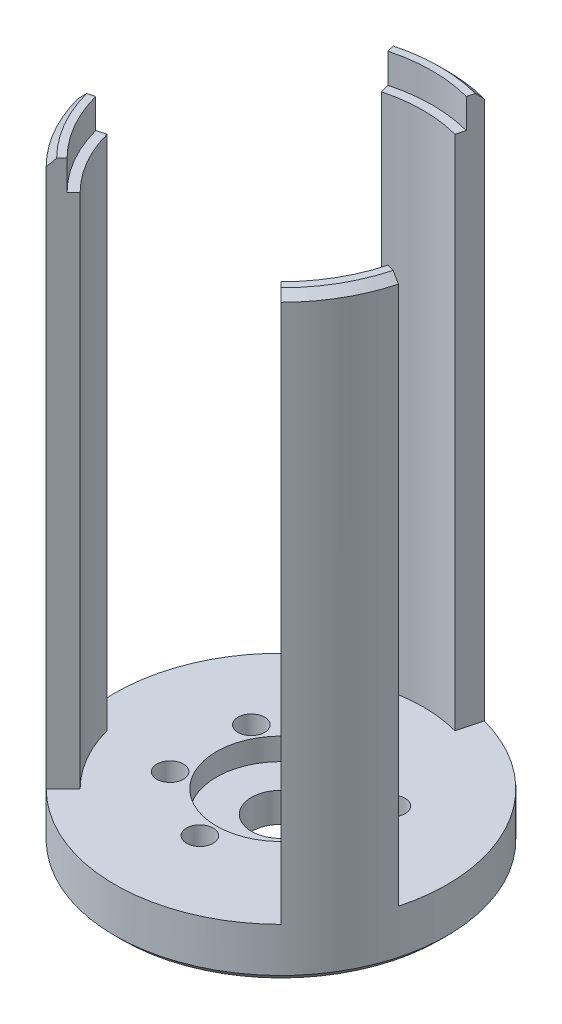
ISO-10303-21;
HEADER;
FILE_DESCRIPTION(('STEP AP214'),'2;1');
FILE_NAME('part.step','',(''),(''),'','','');
FILE_SCHEMA(('AUTOMOTIVE_DESIGN { 1 0 10303 214 1 1 1 1 }'));
ENDSEC;
DATA;
#1=APPLICATION_CONTEXT('core data for automotive mechanical design processes');
#2=APPLICATION_PROTOCOL_DEFINITION('international standard','automotive_design',2000,#1);
#3=PRODUCT_CONTEXT('',#1,'mechanical');
#4=PRODUCT('Part','Part','',(#3));
#5=PRODUCT_RELATED_PRODUCT_CATEGORY('part','',(#4));
#6=PRODUCT_DEFINITION_FORMATION('','',#4);
#7=PRODUCT_DEFINITION_CONTEXT('part definition',#1,'design');
#8=PRODUCT_DEFINITION('design','',#6,#7);
#9=PRODUCT_DEFINITION_SHAPE('','',#8);
#10=(LENGTH_UNIT() NAMED_UNIT(*) SI_UNIT(.MILLI.,.METRE.));
#11=(NAMED_UNIT(*) PLANE_ANGLE_UNIT() SI_UNIT($,.RADIAN.));
#12=(NAMED_UNIT(*) SI_UNIT($,.STERADIAN.) SOLID_ANGLE_UNIT());
#13=UNCERTAINTY_MEASURE_WITH_UNIT(LENGTH_MEASURE(1.E-05),#10,'distance_accuracy_value','');
#14=(GEOMETRIC_REPRESENTATION_CONTEXT(3) GLOBAL_UNCERTAINTY_ASSIGNED_CONTEXT((#13)) GLOBAL_UNIT_ASSIGNED_CONTEXT((#10,
#11,#12)) REPRESENTATION_CONTEXT('',''));
#15=CARTESIAN_POINT('',(0.,0.,0.));
#16=DIRECTION('',(0.,0.,1.));
#17=DIRECTION('',(1.,0.,0.));
#18=AXIS2_PLACEMENT_3D('',#15,#16,#17);
#19=CARTESIAN_POINT('',(0.,81.,0.));
#20=DIRECTION('',(0.,-1.,0.));
#21=DIRECTION('',(0.,0.,-1.));
#22=AXIS2_PLACEMENT_3D('',#19,#20,#21);
#23=CYLINDRICAL_SURFACE('',#22,19.25);
#24=CARTESIAN_POINT('',(0.,77.,0.));
#25=DIRECTION('',(0.,1.,0.));
#26=DIRECTION('',(0.,0.,1.));
#27=AXIS2_PLACEMENT_3D('',#24,#25,#26);
#28=CIRCLE('',#27,19.25);
#29=CARTESIAN_POINT('',(18.5940721560646,77.,4.98226661822351));
#30=VERTEX_POINT('',#29);
#31=CARTESIAN_POINT('',(13.611805537841,77.,13.611805537841));
#32=VERTEX_POINT('',#31);
#33=EDGE_CURVE('E196',#30,#32,#28,.F.);
#34=ORIENTED_EDGE('',*,*,#33,.F.);
#35=DIRECTION('',(0.,-1.,0.));
#36=VECTOR('',#35,1.);
#37=CARTESIAN_POINT('',(18.5940721560646,81.,4.98226661822351));
#38=LINE('',#37,#36);
#39=CARTESIAN_POINT('',(18.5940721560646,7.,4.98226661822351));
#40=VERTEX_POINT('',#39);
#41=EDGE_CURVE('E314',#30,#40,#38,.T.);
#42=ORIENTED_EDGE('',*,*,#41,.T.);
#43=CARTESIAN_POINT('',(0.,7.,0.));
#44=DIRECTION('',(0.,-1.,0.));
#45=DIRECTION('',(0.,0.,1.));
#46=AXIS2_PLACEMENT_3D('',#43,#44,#45);
#47=CIRCLE('',#46,19.25);
#48=CARTESIAN_POINT('',(13.611805537841,7.,13.611805537841));
#49=VERTEX_POINT('',#48);
#50=EDGE_CURVE('E307',#40,#49,#47,.T.);
#51=ORIENTED_EDGE('',*,*,#50,.T.);
#52=DIRECTION('',(0.,-1.,0.));
#53=VECTOR('',#52,1.);
#54=CARTESIAN_POINT('',(13.611805537841,81.,13.611805537841));
#55=LINE('',#54,#53);
#56=EDGE_CURVE('E333',#32,#49,#55,.T.);
#57=ORIENTED_EDGE('',*,*,#56,.F.);
#58=EDGE_LOOP('',(#34,#42,#51,#57));
#59=FACE_BOUND('',#58,.T.);
#60=ADVANCED_FACE('F43',(#59),#23,.F.);
#61=CARTESIAN_POINT('',(0.,81.,0.));
#62=DIRECTION('',(0.,-1.,0.));
#63=DIRECTION('',(0.,0.,-1.));
#64=AXIS2_PLACEMENT_3D('',#61,#62,#63);
#65=CYLINDRICAL_SURFACE('',#64,19.25);
#66=CARTESIAN_POINT('',(0.,77.,0.));
#67=DIRECTION('',(0.,1.,0.));
#68=DIRECTION('',(0.,0.,1.));
#69=AXIS2_PLACEMENT_3D('',#66,#67,#68);
#70=CIRCLE('',#69,19.25);
#71=CARTESIAN_POINT('',(-4.98226661822354,77.,-18.5940721560646));
#72=VERTEX_POINT('',#71);
#73=CARTESIAN_POINT('',(4.98226661822354,77.,-18.5940721560646));
#74=VERTEX_POINT('',#73);
#75=EDGE_CURVE('E236',#72,#74,#70,.F.);
#76=ORIENTED_EDGE('',*,*,#75,.F.);
#77=DIRECTION('',(0.,-1.,0.));
#78=VECTOR('',#77,1.);
#79=CARTESIAN_POINT('',(-4.98226661822354,81.,-18.5940721560646));
#80=LINE('',#79,#78);
#81=CARTESIAN_POINT('',(-4.98226661822354,7.,-18.5940721560646));
#82=VERTEX_POINT('',#81);
#83=EDGE_CURVE('E285',#72,#82,#80,.T.);
#84=ORIENTED_EDGE('',*,*,#83,.T.);
#85=CARTESIAN_POINT('',(0.,7.,0.));
#86=DIRECTION('',(0.,-1.,0.));
#87=DIRECTION('',(0.,0.,1.));
#88=AXIS2_PLACEMENT_3D('',#85,#86,#87);
#89=CIRCLE('',#88,19.25);
#90=CARTESIAN_POINT('',(4.98226661822354,7.00000000000001,-18.5940721560646));
#91=VERTEX_POINT('',#90);
#92=EDGE_CURVE('E276',#82,#91,#89,.T.);
#93=ORIENTED_EDGE('',*,*,#92,.T.);
#94=DIRECTION('',(0.,-1.,0.));
#95=VECTOR('',#94,1.);
#96=CARTESIAN_POINT('',(4.98226661822354,81.,-18.5940721560646));
#97=LINE('',#96,#95);
#98=EDGE_CURVE('E304',#74,#91,#97,.T.);
#99=ORIENTED_EDGE('',*,*,#98,.F.);
#100=EDGE_LOOP('',(#76,#84,#93,#99));
#101=FACE_BOUND('',#100,.T.);
#102=ADVANCED_FACE('F550',(#101),#65,.F.);
#103=CARTESIAN_POINT('',(0.,81.,0.));
#104=DIRECTION('',(0.,-1.,0.));
#105=DIRECTION('',(0.,0.,-1.));
#106=AXIS2_PLACEMENT_3D('',#103,#104,#105);
#107=CYLINDRICAL_SURFACE('',#106,19.25);
#108=CARTESIAN_POINT('',(0.,77.,0.));
#109=DIRECTION('',(0.,1.,0.));
#110=DIRECTION('',(0.,0.,1.));
#111=AXIS2_PLACEMENT_3D('',#108,#109,#110);
#112=CIRCLE('',#111,19.25);
#113=CARTESIAN_POINT('',(-13.611805537841,77.,13.6118055378411));
#114=VERTEX_POINT('',#113);
#115=CARTESIAN_POINT('',(-18.5940721560646,77.,4.98226661822352));
#116=VERTEX_POINT('',#115);
#117=EDGE_CURVE('E221',#114,#116,#112,.F.);
#118=ORIENTED_EDGE('',*,*,#117,.F.);
#119=DIRECTION('',(0.,-1.,0.));
#120=VECTOR('',#119,1.);
#121=CARTESIAN_POINT('',(-13.611805537841,81.,13.6118055378411));
#122=LINE('',#121,#120);
#123=CARTESIAN_POINT('',(-13.611805537841,7.,13.6118055378411));
#124=VERTEX_POINT('',#123);
#125=EDGE_CURVE('E254',#114,#124,#122,.T.);
#126=ORIENTED_EDGE('',*,*,#125,.T.);
#127=CARTESIAN_POINT('',(0.,7.,0.));
#128=DIRECTION('',(0.,-1.,0.));
#129=DIRECTION('',(0.,0.,1.));
#130=AXIS2_PLACEMENT_3D('',#127,#128,#129);
#131=CIRCLE('',#130,19.25);
#132=CARTESIAN_POINT('',(-18.5940721560646,7.00000000000001,4.98226661822352));
#133=VERTEX_POINT('',#132);
#134=EDGE_CURVE('E201',#124,#133,#131,.T.);
#135=ORIENTED_EDGE('',*,*,#134,.T.);
#136=DIRECTION('',(0.,-1.,0.));
#137=VECTOR('',#136,1.);
#138=CARTESIAN_POINT('',(-18.5940721560646,81.,4.98226661822352));
#139=LINE('',#138,#137);
#140=EDGE_CURVE('E273',#116,#133,#139,.T.);
#141=ORIENTED_EDGE('',*,*,#140,.F.);
#142=EDGE_LOOP('',(#118,#126,#135,#141));
#143=FACE_BOUND('',#142,.T.);
#144=ADVANCED_FACE('F579',(#143),#107,.F.);
#145=CARTESIAN_POINT('',(0.,7.,0.));
#146=DIRECTION('',(0.,1.,0.));
#147=DIRECTION('',(0.,0.,1.));
#148=AXIS2_PLACEMENT_3D('',#145,#146,#147);
#149=PLANE('',#148);
#150=CARTESIAN_POINT('',(0.,7.,0.));
#151=DIRECTION('',(0.,1.,0.));
#152=DIRECTION('',(0.,0.,1.));
#153=AXIS2_PLACEMENT_3D('',#150,#151,#152);
#154=CIRCLE('',#153,8.75);
#155=CARTESIAN_POINT('',(0.,7.,8.75));
#156=VERTEX_POINT('',#155);
#157=EDGE_CURVE('E366',#156,#156,#154,.T.);
#158=ORIENTED_EDGE('',*,*,#157,.F.);
#159=EDGE_LOOP('',(#158));
#160=FACE_BOUND('',#159,.T.);
#161=CARTESIAN_POINT('',(-9.52627944162778,7.,-5.5000000000018));
#162=DIRECTION('',(0.,1.,0.));
#163=DIRECTION('',(0.,0.,1.));
#164=AXIS2_PLACEMENT_3D('',#161,#162,#163);
#165=CIRCLE('',#164,1.8);
#166=CARTESIAN_POINT('',(-9.52627944162778,7.,-3.7000000000018));
#167=VERTEX_POINT('',#166);
#168=EDGE_CURVE('E375',#167,#167,#165,.T.);
#169=ORIENTED_EDGE('',*,*,#168,.F.);
#170=EDGE_LOOP('',(#169));
#171=FACE_BOUND('',#170,.T.);
#172=CARTESIAN_POINT('',(-1.2490009027033E-12,7.,11.));
#173=DIRECTION('',(0.,1.,0.));
#174=DIRECTION('',(0.,0.,1.));
#175=AXIS2_PLACEMENT_3D('',#172,#173,#174);
#176=CIRCLE('',#175,1.8);
#177=CARTESIAN_POINT('',(-1.2490009027033E-12,7.,12.8));
#178=VERTEX_POINT('',#177);
#179=EDGE_CURVE('E384',#178,#178,#176,.T.);
#180=ORIENTED_EDGE('',*,*,#179,.F.);
#181=EDGE_LOOP('',(#180));
#182=FACE_BOUND('',#181,.T.);
#183=CARTESIAN_POINT('',(9.52627944162903,7.,-5.49999999999964));
#184=DIRECTION('',(0.,1.,0.));
#185=DIRECTION('',(0.,0.,1.));
#186=AXIS2_PLACEMENT_3D('',#183,#184,#185);
#187=CIRCLE('',#186,1.8);
#188=CARTESIAN_POINT('',(9.52627944162903,7.,-3.69999999999964));
#189=VERTEX_POINT('',#188);
#190=EDGE_CURVE('E396',#189,#189,#187,.T.);
#191=ORIENTED_EDGE('',*,*,#190,.F.);
#192=EDGE_LOOP('',(#191));
#193=FACE_BOUND('',#192,.T.);
#194=CARTESIAN_POINT('',(0.,7.,-11.));
#195=DIRECTION('',(0.,1.,0.));
#196=DIRECTION('',(0.,0.,1.));
#197=AXIS2_PLACEMENT_3D('',#194,#195,#196);
#198=CIRCLE('',#197,1.8);
#199=CARTESIAN_POINT('',(0.,7.,-9.2));
#200=VERTEX_POINT('',#199);
#201=EDGE_CURVE('E404',#200,#200,#198,.T.);
#202=ORIENTED_EDGE('',*,*,#201,.F.);
#203=EDGE_LOOP('',(#202));
#204=FACE_BOUND('',#203,.T.);
#205=CARTESIAN_POINT('',(9.52627944162841,7.,5.50000000000072));
#206=DIRECTION('',(0.,1.,0.));
#207=DIRECTION('',(0.,0.,1.));
#208=AXIS2_PLACEMENT_3D('',#205,#206,#207);
#209=CIRCLE('',#208,1.8);
#210=CARTESIAN_POINT('',(9.52627944162841,7.,7.30000000000072));
#211=VERTEX_POINT('',#210);
#212=EDGE_CURVE('E392',#211,#211,#209,.T.);
#213=ORIENTED_EDGE('',*,*,#212,.F.);
#214=EDGE_LOOP('',(#213));
#215=FACE_BOUND('',#214,.T.);
#216=CARTESIAN_POINT('',(-9.52627944162966,7.,5.49999999999856));
#217=DIRECTION('',(0.,1.,0.));
#218=DIRECTION('',(0.,0.,1.));
#219=AXIS2_PLACEMENT_3D('',#216,#217,#218);
#220=CIRCLE('',#219,1.8);
#221=CARTESIAN_POINT('',(-9.52627944162966,7.,7.29999999999856));
#222=VERTEX_POINT('',#221);
#223=EDGE_CURVE('E380',#222,#222,#220,.T.);
#224=ORIENTED_EDGE('',*,*,#223,.F.);
#225=EDGE_LOOP('',(#224));
#226=FACE_BOUND('',#225,.T.);
#227=CARTESIAN_POINT('',(0.,7.,0.));
#228=DIRECTION('',(0.,1.,0.));
#229=DIRECTION('',(0.,0.,1.));
#230=AXIS2_PLACEMENT_3D('',#227,#228,#229);
#231=CIRCLE('',#230,22.5);
#232=CARTESIAN_POINT('',(-5.82342851480673,7.,-21.733331091504));
#233=VERTEX_POINT('',#232);
#234=CARTESIAN_POINT('',(-21.733331091504,7.,5.82342851480671));
#235=VERTEX_POINT('',#234);
#236=EDGE_CURVE('E417',#233,#235,#231,.T.);
#237=ORIENTED_EDGE('',*,*,#236,.T.);
#238=DIRECTION('',(-0.965925826289069,0.,0.25881904510252));
#239=VECTOR('',#238,1.);
#240=CARTESIAN_POINT('',(-18.5940721560646,7.,4.98226661822352));
#241=LINE('',#240,#239);
#242=EDGE_CURVE('E258',#133,#235,#241,.T.);
#243=ORIENTED_EDGE('',*,*,#242,.F.);
#244=ORIENTED_EDGE('',*,*,#134,.F.);
#245=DIRECTION('',(0.707106781186546,0.,-0.707106781186549));
#246=VECTOR('',#245,1.);
#247=CARTESIAN_POINT('',(-13.611805537841,7.,13.6118055378411));
#248=LINE('',#247,#246);
#249=CARTESIAN_POINT('',(-15.9099025766973,7.,15.9099025766973));
#250=VERTEX_POINT('',#249);
#251=EDGE_CURVE('E251',#250,#124,#248,.T.);
#252=ORIENTED_EDGE('',*,*,#251,.F.);
#253=CARTESIAN_POINT('',(15.9099025766973,7.,15.9099025766973));
#254=VERTEX_POINT('',#253);
#255=EDGE_CURVE('E408',#250,#254,#231,.T.);
#256=ORIENTED_EDGE('',*,*,#255,.T.);
#257=DIRECTION('',(0.707106781186547,0.,0.707106781186548));
#258=VECTOR('',#257,1.);
#259=CARTESIAN_POINT('',(13.611805537841,7.,13.611805537841));
#260=LINE('',#259,#258);
#261=EDGE_CURVE('E318',#49,#254,#260,.T.);
#262=ORIENTED_EDGE('',*,*,#261,.F.);
#263=ORIENTED_EDGE('',*,*,#50,.F.);
#264=DIRECTION('',(-0.965925826289069,0.,-0.25881904510252));
#265=VECTOR('',#264,1.);
#266=CARTESIAN_POINT('',(18.5940721560646,7.,4.98226661822351));
#267=LINE('',#266,#265);
#268=CARTESIAN_POINT('',(21.733331091504,7.,5.8234285148067));
#269=VERTEX_POINT('',#268);
#270=EDGE_CURVE('E311',#269,#40,#267,.T.);
#271=ORIENTED_EDGE('',*,*,#270,.F.);
#272=CARTESIAN_POINT('',(5.82342851480673,7.,-21.733331091504));
#273=VERTEX_POINT('',#272);
#274=EDGE_CURVE('E412',#269,#273,#231,.T.);
#275=ORIENTED_EDGE('',*,*,#274,.T.);
#276=DIRECTION('',(0.258819045102522,0.,-0.965925826289068));
#277=VECTOR('',#276,1.);
#278=CARTESIAN_POINT('',(4.98226661822354,7.,-18.5940721560646));
#279=LINE('',#278,#277);
#280=EDGE_CURVE('E289',#91,#273,#279,.T.);
#281=ORIENTED_EDGE('',*,*,#280,.F.);
#282=ORIENTED_EDGE('',*,*,#92,.F.);
#283=DIRECTION('',(0.258819045102522,0.,0.965925826289068));
#284=VECTOR('',#283,1.);
#285=CARTESIAN_POINT('',(-4.98226661822354,7.,-18.5940721560646));
#286=LINE('',#285,#284);
#287=EDGE_CURVE('E282',#233,#82,#286,.T.);
#288=ORIENTED_EDGE('',*,*,#287,.F.);
#289=EDGE_LOOP('',(#237,#243,#244,#252,#256,#262,#263,#271,#275,#281,#282,#288));
#290=FACE_BOUND('',#289,.T.);
#291=ADVANCED_FACE('F483',(#160,#171,#182,#193,#204,#215,#226,#290),#149,.T.);
#292=CARTESIAN_POINT('',(9.52627944162903,7.,-5.49999999999964));
#293=DIRECTION('',(0.,-1.,0.));
#294=DIRECTION('',(0.,0.,-1.));
#295=AXIS2_PLACEMENT_3D('',#292,#293,#294);
#296=CYLINDRICAL_SURFACE('',#295,1.8);
#297=ORIENTED_EDGE('',*,*,#190,.T.);
#298=EDGE_LOOP('',(#297));
#299=FACE_BOUND('',#298,.T.);
#300=CARTESIAN_POINT('',(9.52627944162903,2.5,-5.49999999999964));
#301=DIRECTION('',(0.,-1.,0.));
#302=DIRECTION('',(0.,0.,-1.));
#303=AXIS2_PLACEMENT_3D('',#300,#301,#302);
#304=CIRCLE('',#303,1.8);
#305=CARTESIAN_POINT('',(9.52627944162903,2.5,-7.29999999999964));
#306=VERTEX_POINT('',#305);
#307=EDGE_CURVE('E370',#306,#306,#304,.T.);
#308=ORIENTED_EDGE('',*,*,#307,.T.);
#309=EDGE_LOOP('',(#308));
#310=FACE_BOUND('',#309,.T.);
#311=ADVANCED_FACE('F586',(#299,#310),#296,.F.);
#312=CARTESIAN_POINT('',(-1.2490009027033E-12,7.,11.));
#313=DIRECTION('',(0.,-1.,0.));
#314=DIRECTION('',(0.,0.,-1.));
#315=AXIS2_PLACEMENT_3D('',#312,#313,#314);
#316=CYLINDRICAL_SURFACE('',#315,1.8);
#317=ORIENTED_EDGE('',*,*,#179,.T.);
#318=EDGE_LOOP('',(#317));
#319=FACE_BOUND('',#318,.T.);
#320=CARTESIAN_POINT('',(-1.2490009027033E-12,2.5,11.));
#321=DIRECTION('',(0.,-1.,0.));
#322=DIRECTION('',(0.,0.,-1.));
#323=AXIS2_PLACEMENT_3D('',#320,#321,#322);
#324=CIRCLE('',#323,1.8);
#325=CARTESIAN_POINT('',(-1.2490009027033E-12,2.5,9.2));
#326=VERTEX_POINT('',#325);
#327=EDGE_CURVE('E424',#326,#326,#324,.T.);
#328=ORIENTED_EDGE('',*,*,#327,.T.);
#329=EDGE_LOOP('',(#328));
#330=FACE_BOUND('',#329,.T.);
#331=ADVANCED_FACE('F640',(#319,#330),#316,.F.);
#332=CARTESIAN_POINT('',(-9.52627944162778,7.,-5.5000000000018));
#333=DIRECTION('',(0.,-1.,0.));
#334=DIRECTION('',(0.,0.,-1.));
#335=AXIS2_PLACEMENT_3D('',#332,#333,#334);
#336=CYLINDRICAL_SURFACE('',#335,1.8);
#337=ORIENTED_EDGE('',*,*,#168,.T.);
#338=EDGE_LOOP('',(#337));
#339=FACE_BOUND('',#338,.T.);
#340=CARTESIAN_POINT('',(-9.52627944162778,2.5,-5.5000000000018));
#341=DIRECTION('',(0.,-1.,0.));
#342=DIRECTION('',(0.,0.,-1.));
#343=AXIS2_PLACEMENT_3D('',#340,#341,#342);
#344=CIRCLE('',#343,1.8);
#345=CARTESIAN_POINT('',(-9.52627944162778,2.5,-7.3000000000018));
#346=VERTEX_POINT('',#345);
#347=EDGE_CURVE('E341',#346,#346,#344,.T.);
#348=ORIENTED_EDGE('',*,*,#347,.T.);
#349=EDGE_LOOP('',(#348));
#350=FACE_BOUND('',#349,.T.);
#351=ADVANCED_FACE('F636',(#339,#350),#336,.F.);
#352=CARTESIAN_POINT('',(0.,7.,0.));
#353=DIRECTION('',(0.,-1.,0.));
#354=DIRECTION('',(0.,0.,-1.));
#355=AXIS2_PLACEMENT_3D('',#352,#353,#354);
#356=CYLINDRICAL_SURFACE('',#355,4.);
#357=CARTESIAN_POINT('',(0.,0.,0.));
#358=DIRECTION('',(0.,1.,0.));
#359=DIRECTION('',(0.,0.,1.));
#360=AXIS2_PLACEMENT_3D('',#357,#358,#359);
#361=CIRCLE('',#360,4.);
#362=CARTESIAN_POINT('',(0.,0.,4.));
#363=VERTEX_POINT('',#362);
#364=EDGE_CURVE('E371',#363,#363,#361,.T.);
#365=ORIENTED_EDGE('',*,*,#364,.F.);
#366=EDGE_LOOP('',(#365));
#367=FACE_BOUND('',#366,.T.);
#368=CARTESIAN_POINT('',(0.,4.,0.));
#369=DIRECTION('',(0.,1.,0.));
#370=DIRECTION('',(0.,0.,1.));
#371=AXIS2_PLACEMENT_3D('',#368,#369,#370);
#372=CIRCLE('',#371,4.);
#373=CARTESIAN_POINT('',(0.,4.,4.));
#374=VERTEX_POINT('',#373);
#375=EDGE_CURVE('E365',#374,#374,#372,.T.);
#376=ORIENTED_EDGE('',*,*,#375,.T.);
#377=EDGE_LOOP('',(#376));
#378=FACE_BOUND('',#377,.T.);
#379=ADVANCED_FACE('F632',(#367,#378),#356,.F.);
#380=CARTESIAN_POINT('',(0.,0.,0.));
#381=DIRECTION('',(0.,1.,0.));
#382=DIRECTION('',(0.,0.,1.));
#383=AXIS2_PLACEMENT_3D('',#380,#381,#382);
#384=PLANE('',#383);
#385=CARTESIAN_POINT('',(0.,0.,0.));
#386=DIRECTION('',(0.,1.,0.));
#387=DIRECTION('',(0.,0.,1.));
#388=AXIS2_PLACEMENT_3D('',#385,#386,#387);
#389=CIRCLE('',#388,21.5);
#390=CARTESIAN_POINT('',(0.,0.,21.5));
#391=VERTEX_POINT('',#390);
#392=EDGE_CURVE('E11',#391,#391,#389,.F.);
#393=ORIENTED_EDGE('',*,*,#392,.T.);
#394=EDGE_LOOP('',(#393));
#395=FACE_BOUND('',#394,.T.);
#396=CARTESIAN_POINT('',(-1.2490009027033E-12,0.,11.));
#397=DIRECTION('',(0.,-1.,0.));
#398=DIRECTION('',(0.,0.,-1.));
#399=AXIS2_PLACEMENT_3D('',#396,#397,#398);
#400=CIRCLE('',#399,3.25);
#401=CARTESIAN_POINT('',(-1.2490009027033E-12,0.,7.75));
#402=VERTEX_POINT('',#401);
#403=EDGE_CURVE('E342',#402,#402,#400,.T.);
#404=ORIENTED_EDGE('',*,*,#403,.F.);
#405=EDGE_LOOP('',(#404));
#406=FACE_BOUND('',#405,.T.);
#407=CARTESIAN_POINT('',(9.52627944162945,0.,-5.49999999999892));
#408=DIRECTION('',(0.,-1.,0.));
#409=DIRECTION('',(0.,0.,-1.));
#410=AXIS2_PLACEMENT_3D('',#407,#408,#409);
#411=CIRCLE('',#410,3.25000000000105);
#412=CARTESIAN_POINT('',(9.52627944162945,0.,-8.74999999999997));
#413=VERTEX_POINT('',#412);
#414=EDGE_CURVE('E350',#413,#413,#411,.T.);
#415=ORIENTED_EDGE('',*,*,#414,.F.);
#416=EDGE_LOOP('',(#415));
#417=FACE_BOUND('',#416,.T.);
#418=CARTESIAN_POINT('',(-9.5262794416282,0.,-5.50000000000109));
#419=DIRECTION('',(0.,-1.,0.));
#420=DIRECTION('',(0.,0.,-1.));
#421=AXIS2_PLACEMENT_3D('',#418,#419,#420);
#422=CIRCLE('',#421,3.25000000000074);
#423=CARTESIAN_POINT('',(-9.5262794416282,0.,-8.75000000000182));
#424=VERTEX_POINT('',#423);
#425=EDGE_CURVE('E336',#424,#424,#422,.T.);
#426=ORIENTED_EDGE('',*,*,#425,.F.);
#427=EDGE_LOOP('',(#426));
#428=FACE_BOUND('',#427,.T.);
#429=CARTESIAN_POINT('',(0.,0.,-11.));
#430=DIRECTION('',(0.,1.,0.));
#431=DIRECTION('',(0.,0.,1.));
#432=AXIS2_PLACEMENT_3D('',#429,#430,#431);
#433=CIRCLE('',#432,1.8);
#434=CARTESIAN_POINT('',(0.,0.,-9.2));
#435=VERTEX_POINT('',#434);
#436=EDGE_CURVE('E403',#435,#435,#433,.T.);
#437=ORIENTED_EDGE('',*,*,#436,.T.);
#438=EDGE_LOOP('',(#437));
#439=FACE_BOUND('',#438,.T.);
#440=CARTESIAN_POINT('',(9.52627944162841,0.,5.50000000000072));
#441=DIRECTION('',(0.,1.,0.));
#442=DIRECTION('',(0.,0.,1.));
#443=AXIS2_PLACEMENT_3D('',#440,#441,#442);
#444=CIRCLE('',#443,1.8);
#445=CARTESIAN_POINT('',(9.52627944162841,0.,7.30000000000072));
#446=VERTEX_POINT('',#445);
#447=EDGE_CURVE('E391',#446,#446,#444,.T.);
#448=ORIENTED_EDGE('',*,*,#447,.T.);
#449=EDGE_LOOP('',(#448));
#450=FACE_BOUND('',#449,.T.);
#451=CARTESIAN_POINT('',(-9.52627944162966,0.,5.49999999999856));
#452=DIRECTION('',(0.,1.,0.));
#453=DIRECTION('',(0.,0.,1.));
#454=AXIS2_PLACEMENT_3D('',#451,#452,#453);
#455=CIRCLE('',#454,1.8);
#456=CARTESIAN_POINT('',(-9.52627944162966,0.,7.29999999999856));
#457=VERTEX_POINT('',#456);
#458=EDGE_CURVE('E379',#457,#457,#455,.T.);
#459=ORIENTED_EDGE('',*,*,#458,.T.);
#460=EDGE_LOOP('',(#459));
#461=FACE_BOUND('',#460,.T.);
#462=ORIENTED_EDGE('',*,*,#364,.T.);
#463=EDGE_LOOP('',(#462));
#464=FACE_BOUND('',#463,.T.);
#465=ADVANCED_FACE('F635',(#395,#406,#417,#428,#439,#450,#461,#464),#384,.F.);
#466=CARTESIAN_POINT('',(0.,7.,0.));
#467=DIRECTION('',(0.,-1.,0.));
#468=DIRECTION('',(0.,0.,-1.));
#469=AXIS2_PLACEMENT_3D('',#466,#467,#468);
#470=CYLINDRICAL_SURFACE('',#469,22.5);
#471=CARTESIAN_POINT('',(0.,0.999999999999994,0.));
#472=DIRECTION('',(0.,1.,0.));
#473=DIRECTION('',(0.,0.,1.));
#474=AXIS2_PLACEMENT_3D('',#471,#472,#473);
#475=CIRCLE('',#474,22.5);
#476=CARTESIAN_POINT('',(0.,0.999999999999994,22.5));
#477=VERTEX_POINT('',#476);
#478=EDGE_CURVE('E444',#477,#477,#475,.T.);
#479=ORIENTED_EDGE('',*,*,#478,.T.);
#480=EDGE_LOOP('',(#479));
#481=FACE_BOUND('',#480,.T.);
#482=DIRECTION('',(0.,-1.,0.));
#483=VECTOR('',#482,1.);
#484=CARTESIAN_POINT('',(-5.82342851480673,81.,-21.733331091504));
#485=LINE('',#484,#483);
#486=CARTESIAN_POINT('',(-5.82342851480673,80.,-21.733331091504));
#487=VERTEX_POINT('',#486);
#488=EDGE_CURVE('E298',#487,#233,#485,.T.);
#489=ORIENTED_EDGE('',*,*,#488,.F.);
#490=CARTESIAN_POINT('',(0.,80.,0.));
#491=DIRECTION('',(0.,1.,0.));
#492=DIRECTION('',(0.,0.,1.));
#493=AXIS2_PLACEMENT_3D('',#490,#491,#492);
#494=CIRCLE('',#493,22.5);
#495=CARTESIAN_POINT('',(5.82342851480673,80.,-21.733331091504));
#496=VERTEX_POINT('',#495);
#497=EDGE_CURVE('E454',#487,#496,#494,.F.);
#498=ORIENTED_EDGE('',*,*,#497,.T.);
#499=DIRECTION('',(0.,-1.,0.));
#500=VECTOR('',#499,1.);
#501=CARTESIAN_POINT('',(5.82342851480673,81.,-21.733331091504));
#502=LINE('',#501,#500);
#503=EDGE_CURVE('E301',#496,#273,#502,.T.);
#504=ORIENTED_EDGE('',*,*,#503,.T.);
#505=ORIENTED_EDGE('',*,*,#274,.F.);
#506=DIRECTION('',(0.,-1.,0.));
#507=VECTOR('',#506,1.);
#508=CARTESIAN_POINT('',(21.7333310915041,81.,5.8234285148067));
#509=LINE('',#508,#507);
#510=CARTESIAN_POINT('',(21.7333310915041,80.,5.8234285148067));
#511=VERTEX_POINT('',#510);
#512=EDGE_CURVE('E327',#511,#269,#509,.T.);
#513=ORIENTED_EDGE('',*,*,#512,.F.);
#514=CARTESIAN_POINT('',(0.,80.,0.));
#515=DIRECTION('',(0.,1.,0.));
#516=DIRECTION('',(0.,0.,1.));
#517=AXIS2_PLACEMENT_3D('',#514,#515,#516);
#518=CIRCLE('',#517,22.5);
#519=CARTESIAN_POINT('',(15.9099025766973,80.,15.9099025766973));
#520=VERTEX_POINT('',#519);
#521=EDGE_CURVE('E451',#511,#520,#518,.F.);
#522=ORIENTED_EDGE('',*,*,#521,.T.);
#523=DIRECTION('',(0.,-1.,0.));
#524=VECTOR('',#523,1.);
#525=CARTESIAN_POINT('',(15.9099025766973,81.,15.9099025766973));
#526=LINE('',#525,#524);
#527=EDGE_CURVE('E330',#520,#254,#526,.T.);
#528=ORIENTED_EDGE('',*,*,#527,.T.);
#529=ORIENTED_EDGE('',*,*,#255,.F.);
#530=DIRECTION('',(0.,-1.,0.));
#531=VECTOR('',#530,1.);
#532=CARTESIAN_POINT('',(-15.9099025766973,81.,15.9099025766973));
#533=LINE('',#532,#531);
#534=CARTESIAN_POINT('',(-15.9099025766973,80.,15.9099025766973));
#535=VERTEX_POINT('',#534);
#536=EDGE_CURVE('E267',#535,#250,#533,.T.);
#537=ORIENTED_EDGE('',*,*,#536,.F.);
#538=CARTESIAN_POINT('',(0.,80.,0.));
#539=DIRECTION('',(0.,1.,0.));
#540=DIRECTION('',(0.,0.,1.));
#541=AXIS2_PLACEMENT_3D('',#538,#539,#540);
#542=CIRCLE('',#541,22.5);
#543=CARTESIAN_POINT('',(-21.733331091504,80.,5.82342851480671));
#544=VERTEX_POINT('',#543);
#545=EDGE_CURVE('E448',#535,#544,#542,.F.);
#546=ORIENTED_EDGE('',*,*,#545,.T.);
#547=DIRECTION('',(0.,-1.,0.));
#548=VECTOR('',#547,1.);
#549=CARTESIAN_POINT('',(-21.733331091504,81.,5.82342851480671));
#550=LINE('',#549,#548);
#551=EDGE_CURVE('E270',#544,#235,#550,.T.);
#552=ORIENTED_EDGE('',*,*,#551,.T.);
#553=ORIENTED_EDGE('',*,*,#236,.F.);
#554=EDGE_LOOP('',(#489,#498,#504,#505,#513,#522,#528,#529,#537,#546,#552,#553));
#555=FACE_BOUND('',#554,.T.);
#556=ADVANCED_FACE('F499',(#481,#555),#470,.T.);
#557=CARTESIAN_POINT('',(0.,7.,-11.));
#558=DIRECTION('',(0.,-1.,0.));
#559=DIRECTION('',(0.,0.,-1.));
#560=AXIS2_PLACEMENT_3D('',#557,#558,#559);
#561=CYLINDRICAL_SURFACE('',#560,1.8);
#562=ORIENTED_EDGE('',*,*,#201,.T.);
#563=EDGE_LOOP('',(#562));
#564=FACE_BOUND('',#563,.T.);
#565=ORIENTED_EDGE('',*,*,#436,.F.);
#566=EDGE_LOOP('',(#565));
#567=FACE_BOUND('',#566,.T.);
#568=ADVANCED_FACE('F651',(#564,#567),#561,.F.);
#569=CARTESIAN_POINT('',(9.52627944162841,7.,5.50000000000072));
#570=DIRECTION('',(0.,-1.,0.));
#571=DIRECTION('',(0.,0.,-1.));
#572=AXIS2_PLACEMENT_3D('',#569,#570,#571);
#573=CYLINDRICAL_SURFACE('',#572,1.8);
#574=ORIENTED_EDGE('',*,*,#212,.T.);
#575=EDGE_LOOP('',(#574));
#576=FACE_BOUND('',#575,.T.);
#577=ORIENTED_EDGE('',*,*,#447,.F.);
#578=EDGE_LOOP('',(#577));
#579=FACE_BOUND('',#578,.T.);
#580=ADVANCED_FACE('F644',(#576,#579),#573,.F.);
#581=CARTESIAN_POINT('',(-9.52627944162966,7.,5.49999999999856));
#582=DIRECTION('',(0.,-1.,0.));
#583=DIRECTION('',(0.,0.,-1.));
#584=AXIS2_PLACEMENT_3D('',#581,#582,#583);
#585=CYLINDRICAL_SURFACE('',#584,1.8);
#586=ORIENTED_EDGE('',*,*,#223,.T.);
#587=EDGE_LOOP('',(#586));
#588=FACE_BOUND('',#587,.T.);
#589=ORIENTED_EDGE('',*,*,#458,.F.);
#590=EDGE_LOOP('',(#589));
#591=FACE_BOUND('',#590,.T.);
#592=ADVANCED_FACE('F630',(#588,#591),#585,.F.);
#593=CARTESIAN_POINT('',(0.,4.,0.));
#594=DIRECTION('',(0.,1.,0.));
#595=DIRECTION('',(0.,0.,1.));
#596=AXIS2_PLACEMENT_3D('',#593,#594,#595);
#597=CYLINDRICAL_SURFACE('',#596,8.75);
#598=CARTESIAN_POINT('',(0.,4.,0.));
#599=DIRECTION('',(0.,1.,0.));
#600=DIRECTION('',(0.,0.,1.));
#601=AXIS2_PLACEMENT_3D('',#598,#599,#600);
#602=CIRCLE('',#601,8.75);
#603=CARTESIAN_POINT('',(0.,4.,8.75));
#604=VERTEX_POINT('',#603);
#605=EDGE_CURVE('E361',#604,#604,#602,.T.);
#606=ORIENTED_EDGE('',*,*,#605,.F.);
#607=EDGE_LOOP('',(#606));
#608=FACE_BOUND('',#607,.T.);
#609=ORIENTED_EDGE('',*,*,#157,.T.);
#610=EDGE_LOOP('',(#609));
#611=FACE_BOUND('',#610,.T.);
#612=ADVANCED_FACE('F626',(#608,#611),#597,.F.);
#613=CARTESIAN_POINT('',(0.,4.,0.));
#614=DIRECTION('',(0.,1.,0.));
#615=DIRECTION('',(0.,0.,1.));
#616=AXIS2_PLACEMENT_3D('',#613,#614,#615);
#617=PLANE('',#616);
#618=ORIENTED_EDGE('',*,*,#375,.F.);
#619=EDGE_LOOP('',(#618));
#620=FACE_BOUND('',#619,.T.);
#621=ORIENTED_EDGE('',*,*,#605,.T.);
#622=EDGE_LOOP('',(#621));
#623=FACE_BOUND('',#622,.T.);
#624=ADVANCED_FACE('F622',(#620,#623),#617,.T.);
#625=CARTESIAN_POINT('',(-9.5262794416282,2.5,-5.50000000000109));
#626=DIRECTION('',(0.,-1.,0.));
#627=DIRECTION('',(0.,0.,-1.));
#628=AXIS2_PLACEMENT_3D('',#625,#626,#627);
#629=CYLINDRICAL_SURFACE('',#628,3.25000000000074);
#630=CARTESIAN_POINT('',(-9.5262794416282,2.5,-5.50000000000109));
#631=DIRECTION('',(0.,-1.,0.));
#632=DIRECTION('',(0.,0.,-1.));
#633=AXIS2_PLACEMENT_3D('',#630,#631,#632);
#634=CIRCLE('',#633,3.25000000000074);
#635=CARTESIAN_POINT('',(-9.5262794416282,2.5,-8.75000000000182));
#636=VERTEX_POINT('',#635);
#637=EDGE_CURVE('E354',#636,#636,#634,.T.);
#638=ORIENTED_EDGE('',*,*,#637,.F.);
#639=EDGE_LOOP('',(#638));
#640=FACE_BOUND('',#639,.T.);
#641=ORIENTED_EDGE('',*,*,#425,.T.);
#642=EDGE_LOOP('',(#641));
#643=FACE_BOUND('',#642,.T.);
#644=ADVANCED_FACE('F618',(#640,#643),#629,.F.);
#645=CARTESIAN_POINT('',(-9.5262794416282,2.5,-5.50000000000109));
#646=DIRECTION('',(0.,-1.,0.));
#647=DIRECTION('',(0.,0.,-1.));
#648=AXIS2_PLACEMENT_3D('',#645,#646,#647);
#649=PLANE('',#648);
#650=ORIENTED_EDGE('',*,*,#347,.F.);
#651=EDGE_LOOP('',(#650));
#652=FACE_BOUND('',#651,.T.);
#653=ORIENTED_EDGE('',*,*,#637,.T.);
#654=EDGE_LOOP('',(#653));
#655=FACE_BOUND('',#654,.T.);
#656=ADVANCED_FACE('F607',(#652,#655),#649,.T.);
#657=CARTESIAN_POINT('',(-1.2490009027033E-12,2.5,11.));
#658=DIRECTION('',(0.,-1.,0.));
#659=DIRECTION('',(0.,0.,-1.));
#660=AXIS2_PLACEMENT_3D('',#657,#658,#659);
#661=CYLINDRICAL_SURFACE('',#660,3.25);
#662=CARTESIAN_POINT('',(-1.2490009027033E-12,2.5,11.));
#663=DIRECTION('',(0.,-1.,0.));
#664=DIRECTION('',(0.,0.,-1.));
#665=AXIS2_PLACEMENT_3D('',#662,#663,#664);
#666=CIRCLE('',#665,3.25);
#667=CARTESIAN_POINT('',(-1.2490009027033E-12,2.5,7.75));
#668=VERTEX_POINT('',#667);
#669=EDGE_CURVE('E337',#668,#668,#666,.T.);
#670=ORIENTED_EDGE('',*,*,#669,.F.);
#671=EDGE_LOOP('',(#670));
#672=FACE_BOUND('',#671,.T.);
#673=ORIENTED_EDGE('',*,*,#403,.T.);
#674=EDGE_LOOP('',(#673));
#675=FACE_BOUND('',#674,.T.);
#676=ADVANCED_FACE('F603',(#672,#675),#661,.F.);
#677=CARTESIAN_POINT('',(-1.2490009027033E-12,2.5,11.));
#678=DIRECTION('',(0.,-1.,0.));
#679=DIRECTION('',(0.,0.,-1.));
#680=AXIS2_PLACEMENT_3D('',#677,#678,#679);
#681=PLANE('',#680);
#682=ORIENTED_EDGE('',*,*,#327,.F.);
#683=EDGE_LOOP('',(#682));
#684=FACE_BOUND('',#683,.T.);
#685=ORIENTED_EDGE('',*,*,#669,.T.);
#686=EDGE_LOOP('',(#685));
#687=FACE_BOUND('',#686,.T.);
#688=ADVANCED_FACE('F599',(#684,#687),#681,.T.);
#689=CARTESIAN_POINT('',(9.52627944162945,2.5,-5.49999999999892));
#690=DIRECTION('',(0.,-1.,0.));
#691=DIRECTION('',(0.,0.,-1.));
#692=AXIS2_PLACEMENT_3D('',#689,#690,#691);
#693=CYLINDRICAL_SURFACE('',#692,3.25000000000105);
#694=CARTESIAN_POINT('',(9.52627944162945,2.5,-5.49999999999892));
#695=DIRECTION('',(0.,-1.,0.));
#696=DIRECTION('',(0.,0.,-1.));
#697=AXIS2_PLACEMENT_3D('',#694,#695,#696);
#698=CIRCLE('',#697,3.25000000000105);
#699=CARTESIAN_POINT('',(9.52627944162945,2.5,-8.74999999999997));
#700=VERTEX_POINT('',#699);
#701=EDGE_CURVE('E346',#700,#700,#698,.T.);
#702=ORIENTED_EDGE('',*,*,#701,.F.);
#703=EDGE_LOOP('',(#702));
#704=FACE_BOUND('',#703,.T.);
#705=ORIENTED_EDGE('',*,*,#414,.T.);
#706=EDGE_LOOP('',(#705));
#707=FACE_BOUND('',#706,.T.);
#708=ADVANCED_FACE('F602',(#704,#707),#693,.F.);
#709=CARTESIAN_POINT('',(9.52627944162945,2.5,-5.49999999999892));
#710=DIRECTION('',(0.,-1.,0.));
#711=DIRECTION('',(0.,0.,-1.));
#712=AXIS2_PLACEMENT_3D('',#709,#710,#711);
#713=PLANE('',#712);
#714=ORIENTED_EDGE('',*,*,#307,.F.);
#715=EDGE_LOOP('',(#714));
#716=FACE_BOUND('',#715,.T.);
#717=ORIENTED_EDGE('',*,*,#701,.T.);
#718=EDGE_LOOP('',(#717));
#719=FACE_BOUND('',#718,.T.);
#720=ADVANCED_FACE('F609',(#716,#719),#713,.T.);
#721=CARTESIAN_POINT('',(13.611805537841,81.,13.611805537841));
#722=DIRECTION('',(0.707106781186548,0.,-0.707106781186547));
#723=DIRECTION('',(-0.707106781186547,0.,-0.707106781186548));
#724=AXIS2_PLACEMENT_3D('',#721,#722,#723);
#725=PLANE('',#724);
#726=ORIENTED_EDGE('',*,*,#527,.F.);
#727=DIRECTION('',(0.500000000000001,-0.707106781186546,0.500000000000001));
#728=VECTOR('',#727,1.);
#729=CARTESIAN_POINT('',(0.,102.5,0.));
#730=LINE('',#729,#728);
#731=CARTESIAN_POINT('',(15.2027957955108,81.,15.2027957955108));
#732=VERTEX_POINT('',#731);
#733=EDGE_CURVE('E467',#520,#732,#730,.F.);
#734=ORIENTED_EDGE('',*,*,#733,.T.);
#735=DIRECTION('',(0.707106781186547,0.,0.707106781186548));
#736=VECTOR('',#735,1.);
#737=CARTESIAN_POINT('',(13.611805537841,81.,13.611805537841));
#738=LINE('',#737,#736);
#739=CARTESIAN_POINT('',(14.4956890143242,81.,14.4956890143242));
#740=VERTEX_POINT('',#739);
#741=EDGE_CURVE('E219',#740,#732,#738,.T.);
#742=ORIENTED_EDGE('',*,*,#741,.F.);
#743=DIRECTION('',(0.,1.,0.));
#744=VECTOR('',#743,1.);
#745=CARTESIAN_POINT('',(14.4956890143242,77.,14.4956890143242));
#746=LINE('',#745,#744);
#747=CARTESIAN_POINT('',(14.4956890143242,77.,14.4956890143242));
#748=VERTEX_POINT('',#747);
#749=EDGE_CURVE('E206',#740,#748,#746,.F.);
#750=ORIENTED_EDGE('',*,*,#749,.T.);
#751=DIRECTION('',(0.707106781186547,0.,0.707106781186548));
#752=VECTOR('',#751,1.);
#753=CARTESIAN_POINT('',(13.611805537841,77.,13.611805537841));
#754=LINE('',#753,#752);
#755=EDGE_CURVE('E190',#32,#748,#754,.T.);
#756=ORIENTED_EDGE('',*,*,#755,.F.);
#757=ORIENTED_EDGE('',*,*,#56,.T.);
#758=ORIENTED_EDGE('',*,*,#261,.T.);
#759=EDGE_LOOP('',(#726,#734,#742,#750,#756,#757,#758));
#760=FACE_BOUND('',#759,.T.);
#761=ADVANCED_FACE('F217',(#760),#725,.F.);
#762=CARTESIAN_POINT('',(18.5940721560646,81.,4.98226661822351));
#763=DIRECTION('',(-0.25881904510252,0.,0.965925826289069));
#764=DIRECTION('',(0.965925826289069,0.,0.25881904510252));
#765=AXIS2_PLACEMENT_3D('',#762,#763,#764);
#766=PLANE('',#765);
#767=DIRECTION('',(-0.965925826289069,0.,-0.25881904510252));
#768=VECTOR('',#767,1.);
#769=CARTESIAN_POINT('',(18.5940721560646,81.,4.98226661822351));
#770=LINE('',#769,#768);
#771=CARTESIAN_POINT('',(20.767405265215,81.,5.56460946970418));
#772=VERTEX_POINT('',#771);
#773=CARTESIAN_POINT('',(19.8014794389259,81.,5.30579042460166));
#774=VERTEX_POINT('',#773);
#775=EDGE_CURVE('E310',#772,#774,#770,.T.);
#776=ORIENTED_EDGE('',*,*,#775,.F.);
#777=DIRECTION('',(-0.683012701892221,0.707106781186546,-0.183012701892219));
#778=VECTOR('',#777,1.);
#779=CARTESIAN_POINT('',(0.,102.5,0.));
#780=LINE('',#779,#778);
#781=EDGE_CURVE('E464',#772,#511,#780,.F.);
#782=ORIENTED_EDGE('',*,*,#781,.T.);
#783=ORIENTED_EDGE('',*,*,#512,.T.);
#784=ORIENTED_EDGE('',*,*,#270,.T.);
#785=ORIENTED_EDGE('',*,*,#41,.F.);
#786=DIRECTION('',(-0.965925826289069,0.,-0.25881904510252));
#787=VECTOR('',#786,1.);
#788=CARTESIAN_POINT('',(18.5940721560646,77.,4.98226661822351));
#789=LINE('',#788,#787);
#790=CARTESIAN_POINT('',(19.8014794389259,77.,5.30579042460166));
#791=VERTEX_POINT('',#790);
#792=EDGE_CURVE('E242',#791,#30,#789,.T.);
#793=ORIENTED_EDGE('',*,*,#792,.F.);
#794=DIRECTION('',(0.,1.,0.));
#795=VECTOR('',#794,1.);
#796=CARTESIAN_POINT('',(19.8014794389259,77.,5.30579042460166));
#797=LINE('',#796,#795);
#798=EDGE_CURVE('E209',#791,#774,#797,.T.);
#799=ORIENTED_EDGE('',*,*,#798,.T.);
#800=EDGE_LOOP('',(#776,#782,#783,#784,#785,#793,#799));
#801=FACE_BOUND('',#800,.T.);
#802=ADVANCED_FACE('F495',(#801),#766,.F.);
#803=CARTESIAN_POINT('',(0.,81.,0.));
#804=DIRECTION('',(0.,1.,0.));
#805=DIRECTION('',(0.,0.,1.));
#806=AXIS2_PLACEMENT_3D('',#803,#804,#805);
#807=PLANE('',#806);
#808=ORIENTED_EDGE('',*,*,#741,.T.);
#809=CARTESIAN_POINT('',(0.,81.,0.));
#810=DIRECTION('',(0.,1.,0.));
#811=DIRECTION('',(0.,0.,1.));
#812=AXIS2_PLACEMENT_3D('',#809,#810,#811);
#813=CIRCLE('',#812,21.5);
#814=EDGE_CURVE('E460',#732,#772,#813,.T.);
#815=ORIENTED_EDGE('',*,*,#814,.T.);
#816=ORIENTED_EDGE('',*,*,#775,.T.);
#817=CARTESIAN_POINT('',(0.,81.,0.));
#818=DIRECTION('',(0.,1.,0.));
#819=DIRECTION('',(0.,0.,1.));
#820=AXIS2_PLACEMENT_3D('',#817,#818,#819);
#821=CIRCLE('',#820,20.5);
#822=EDGE_CURVE('E505',#740,#774,#821,.T.);
#823=ORIENTED_EDGE('',*,*,#822,.F.);
#824=EDGE_LOOP('',(#808,#815,#816,#823));
#825=FACE_BOUND('',#824,.T.);
#826=ADVANCED_FACE('F504',(#825),#807,.T.);
#827=CARTESIAN_POINT('',(4.98226661822354,81.,-18.5940721560646));
#828=DIRECTION('',(-0.965925826289068,0.,-0.258819045102522));
#829=DIRECTION('',(-0.258819045102522,0.,0.965925826289068));
#830=AXIS2_PLACEMENT_3D('',#827,#828,#829);
#831=PLANE('',#830);
#832=ORIENTED_EDGE('',*,*,#503,.F.);
#833=DIRECTION('',(0.183012701892221,-0.707106781186545,-0.683012701892222));
#834=VECTOR('',#833,1.);
#835=CARTESIAN_POINT('',(0.,102.5,0.));
#836=LINE('',#835,#834);
#837=CARTESIAN_POINT('',(5.56460946970421,81.,-20.767405265215));
#838=VERTEX_POINT('',#837);
#839=EDGE_CURVE('E457',#496,#838,#836,.F.);
#840=ORIENTED_EDGE('',*,*,#839,.T.);
#841=DIRECTION('',(0.258819045102522,0.,-0.965925826289068));
#842=VECTOR('',#841,1.);
#843=CARTESIAN_POINT('',(4.98226661822354,81.,-18.5940721560646));
#844=LINE('',#843,#842);
#845=CARTESIAN_POINT('',(5.30579042460169,81.,-19.8014794389259));
#846=VERTEX_POINT('',#845);
#847=EDGE_CURVE('E277',#846,#838,#844,.T.);
#848=ORIENTED_EDGE('',*,*,#847,.F.);
#849=DIRECTION('',(0.,1.,0.));
#850=VECTOR('',#849,1.);
#851=CARTESIAN_POINT('',(5.30579042460169,77.,-19.8014794389259));
#852=LINE('',#851,#850);
#853=CARTESIAN_POINT('',(5.30579042460169,77.,-19.8014794389259));
#854=VERTEX_POINT('',#853);
#855=EDGE_CURVE('E227',#846,#854,#852,.F.);
#856=ORIENTED_EDGE('',*,*,#855,.T.);
#857=DIRECTION('',(0.258819045102522,0.,-0.965925826289068));
#858=VECTOR('',#857,1.);
#859=CARTESIAN_POINT('',(4.98226661822354,77.,-18.5940721560646));
#860=LINE('',#859,#858);
#861=EDGE_CURVE('E239',#74,#854,#860,.T.);
#862=ORIENTED_EDGE('',*,*,#861,.F.);
#863=ORIENTED_EDGE('',*,*,#98,.T.);
#864=ORIENTED_EDGE('',*,*,#280,.T.);
#865=EDGE_LOOP('',(#832,#840,#848,#856,#862,#863,#864));
#866=FACE_BOUND('',#865,.T.);
#867=ADVANCED_FACE('F530',(#866),#831,.F.);
#868=CARTESIAN_POINT('',(-4.98226661822354,81.,-18.5940721560646));
#869=DIRECTION('',(0.965925826289068,0.,-0.258819045102522));
#870=DIRECTION('',(-0.258819045102522,0.,-0.965925826289068));
#871=AXIS2_PLACEMENT_3D('',#868,#869,#870);
#872=PLANE('',#871);
#873=DIRECTION('',(0.258819045102522,0.,0.965925826289068));
#874=VECTOR('',#873,1.);
#875=CARTESIAN_POINT('',(-4.98226661822354,81.,-18.5940721560646));
#876=LINE('',#875,#874);
#877=CARTESIAN_POINT('',(-5.56460946970421,81.,-20.767405265215));
#878=VERTEX_POINT('',#877);
#879=CARTESIAN_POINT('',(-5.30579042460169,81.,-19.8014794389259));
#880=VERTEX_POINT('',#879);
#881=EDGE_CURVE('E281',#878,#880,#876,.T.);
#882=ORIENTED_EDGE('',*,*,#881,.F.);
#883=DIRECTION('',(0.183012701892221,0.707106781186545,0.683012701892222));
#884=VECTOR('',#883,1.);
#885=CARTESIAN_POINT('',(0.,102.5,0.));
#886=LINE('',#885,#884);
#887=EDGE_CURVE('E441',#878,#487,#886,.F.);
#888=ORIENTED_EDGE('',*,*,#887,.T.);
#889=ORIENTED_EDGE('',*,*,#488,.T.);
#890=ORIENTED_EDGE('',*,*,#287,.T.);
#891=ORIENTED_EDGE('',*,*,#83,.F.);
#892=DIRECTION('',(0.258819045102522,0.,0.965925826289068));
#893=VECTOR('',#892,1.);
#894=CARTESIAN_POINT('',(-4.98226661822354,77.,-18.5940721560646));
#895=LINE('',#894,#893);
#896=CARTESIAN_POINT('',(-5.30579042460169,77.,-19.8014794389259));
#897=VERTEX_POINT('',#896);
#898=EDGE_CURVE('E233',#897,#72,#895,.T.);
#899=ORIENTED_EDGE('',*,*,#898,.F.);
#900=DIRECTION('',(0.,1.,0.));
#901=VECTOR('',#900,1.);
#902=CARTESIAN_POINT('',(-5.30579042460169,77.,-19.8014794389259));
#903=LINE('',#902,#901);
#904=EDGE_CURVE('E521',#897,#880,#903,.T.);
#905=ORIENTED_EDGE('',*,*,#904,.T.);
#906=EDGE_LOOP('',(#882,#888,#889,#890,#891,#899,#905));
#907=FACE_BOUND('',#906,.T.);
#908=ADVANCED_FACE('F542',(#907),#872,.F.);
#909=CARTESIAN_POINT('',(0.,81.,0.));
#910=DIRECTION('',(0.,1.,0.));
#911=DIRECTION('',(0.,0.,1.));
#912=AXIS2_PLACEMENT_3D('',#909,#910,#911);
#913=PLANE('',#912);
#914=ORIENTED_EDGE('',*,*,#847,.T.);
#915=CARTESIAN_POINT('',(0.,81.,0.));
#916=DIRECTION('',(0.,1.,0.));
#917=DIRECTION('',(0.,0.,1.));
#918=AXIS2_PLACEMENT_3D('',#915,#916,#917);
#919=CIRCLE('',#918,21.5);
#920=EDGE_CURVE('E437',#838,#878,#919,.T.);
#921=ORIENTED_EDGE('',*,*,#920,.T.);
#922=ORIENTED_EDGE('',*,*,#881,.T.);
#923=EDGE_CURVE('E507',#846,#880,#821,.T.);
#924=ORIENTED_EDGE('',*,*,#923,.F.);
#925=EDGE_LOOP('',(#914,#921,#922,#924));
#926=FACE_BOUND('',#925,.T.);
#927=ADVANCED_FACE('F538',(#926),#913,.T.);
#928=CARTESIAN_POINT('',(-18.5940721560646,81.,4.98226661822352));
#929=DIRECTION('',(0.25881904510252,0.,0.965925826289068));
#930=DIRECTION('',(0.965925826289069,0.,-0.25881904510252));
#931=AXIS2_PLACEMENT_3D('',#928,#929,#930);
#932=PLANE('',#931);
#933=ORIENTED_EDGE('',*,*,#551,.F.);
#934=DIRECTION('',(-0.683012701892221,-0.707106781186546,0.183012701892219));
#935=VECTOR('',#934,1.);
#936=CARTESIAN_POINT('',(0.,102.5,0.));
#937=LINE('',#936,#935);
#938=CARTESIAN_POINT('',(-20.767405265215,81.,5.5646094697042));
#939=VERTEX_POINT('',#938);
#940=EDGE_CURVE('E53',#544,#939,#937,.F.);
#941=ORIENTED_EDGE('',*,*,#940,.T.);
#942=DIRECTION('',(-0.965925826289069,0.,0.25881904510252));
#943=VECTOR('',#942,1.);
#944=CARTESIAN_POINT('',(-18.5940721560646,81.,4.98226661822352));
#945=LINE('',#944,#943);
#946=CARTESIAN_POINT('',(-19.8014794389259,81.,5.30579042460167));
#947=VERTEX_POINT('',#946);
#948=EDGE_CURVE('E247',#947,#939,#945,.T.);
#949=ORIENTED_EDGE('',*,*,#948,.F.);
#950=DIRECTION('',(0.,1.,0.));
#951=VECTOR('',#950,1.);
#952=CARTESIAN_POINT('',(-19.8014794389259,77.,5.30579042460167));
#953=LINE('',#952,#951);
#954=CARTESIAN_POINT('',(-19.8014794389259,77.,5.30579042460167));
#955=VERTEX_POINT('',#954);
#956=EDGE_CURVE('E517',#947,#955,#953,.F.);
#957=ORIENTED_EDGE('',*,*,#956,.T.);
#958=DIRECTION('',(-0.965925826289069,0.,0.25881904510252));
#959=VECTOR('',#958,1.);
#960=CARTESIAN_POINT('',(-18.5940721560646,77.,4.98226661822352));
#961=LINE('',#960,#959);
#962=EDGE_CURVE('E225',#116,#955,#961,.T.);
#963=ORIENTED_EDGE('',*,*,#962,.F.);
#964=ORIENTED_EDGE('',*,*,#140,.T.);
#965=ORIENTED_EDGE('',*,*,#242,.T.);
#966=EDGE_LOOP('',(#933,#941,#949,#957,#963,#964,#965));
#967=FACE_BOUND('',#966,.T.);
#968=ADVANCED_FACE('F560',(#967),#932,.F.);
#969=CARTESIAN_POINT('',(-13.611805537841,81.,13.6118055378411));
#970=DIRECTION('',(-0.707106781186549,0.,-0.707106781186546));
#971=DIRECTION('',(-0.707106781186546,0.,0.707106781186549));
#972=AXIS2_PLACEMENT_3D('',#969,#970,#971);
#973=PLANE('',#972);
#974=DIRECTION('',(0.707106781186546,0.,-0.707106781186549));
#975=VECTOR('',#974,1.);
#976=CARTESIAN_POINT('',(-13.611805537841,81.,13.6118055378411));
#977=LINE('',#976,#975);
#978=CARTESIAN_POINT('',(-15.2027957955108,81.,15.2027957955108));
#979=VERTEX_POINT('',#978);
#980=CARTESIAN_POINT('',(-14.4956890143242,81.,14.4956890143242));
#981=VERTEX_POINT('',#980);
#982=EDGE_CURVE('E250',#979,#981,#977,.T.);
#983=ORIENTED_EDGE('',*,*,#982,.F.);
#984=DIRECTION('',(0.5,0.707106781186546,-0.500000000000002));
#985=VECTOR('',#984,1.);
#986=CARTESIAN_POINT('',(0.,102.5,0.));
#987=LINE('',#986,#985);
#988=EDGE_CURVE('E60',#979,#535,#987,.F.);
#989=ORIENTED_EDGE('',*,*,#988,.T.);
#990=ORIENTED_EDGE('',*,*,#536,.T.);
#991=ORIENTED_EDGE('',*,*,#251,.T.);
#992=ORIENTED_EDGE('',*,*,#125,.F.);
#993=DIRECTION('',(0.707106781186546,0.,-0.707106781186549));
#994=VECTOR('',#993,1.);
#995=CARTESIAN_POINT('',(-13.611805537841,77.,13.6118055378411));
#996=LINE('',#995,#994);
#997=CARTESIAN_POINT('',(-14.4956890143242,77.,14.4956890143242));
#998=VERTEX_POINT('',#997);
#999=EDGE_CURVE('E434',#998,#114,#996,.T.);
#1000=ORIENTED_EDGE('',*,*,#999,.F.);
#1001=DIRECTION('',(0.,1.,0.));
#1002=VECTOR('',#1001,1.);
#1003=CARTESIAN_POINT('',(-14.4956890143242,77.,14.4956890143242));
#1004=LINE('',#1003,#1002);
#1005=EDGE_CURVE('E211',#998,#981,#1004,.T.);
#1006=ORIENTED_EDGE('',*,*,#1005,.T.);
#1007=EDGE_LOOP('',(#983,#989,#990,#991,#992,#1000,#1006));
#1008=FACE_BOUND('',#1007,.T.);
#1009=ADVANCED_FACE('F567',(#1008),#973,.F.);
#1010=CARTESIAN_POINT('',(0.,81.,0.));
#1011=DIRECTION('',(0.,1.,0.));
#1012=DIRECTION('',(0.,0.,1.));
#1013=AXIS2_PLACEMENT_3D('',#1010,#1011,#1012);
#1014=PLANE('',#1013);
#1015=ORIENTED_EDGE('',*,*,#948,.T.);
#1016=CARTESIAN_POINT('',(0.,81.,0.));
#1017=DIRECTION('',(0.,1.,0.));
#1018=DIRECTION('',(0.,0.,1.));
#1019=AXIS2_PLACEMENT_3D('',#1016,#1017,#1018);
#1020=CIRCLE('',#1019,21.5);
#1021=EDGE_CURVE('E470',#939,#979,#1020,.T.);
#1022=ORIENTED_EDGE('',*,*,#1021,.T.);
#1023=ORIENTED_EDGE('',*,*,#982,.T.);
#1024=CARTESIAN_POINT('',(0.,81.,0.));
#1025=DIRECTION('',(0.,1.,0.));
#1026=DIRECTION('',(0.,0.,1.));
#1027=AXIS2_PLACEMENT_3D('',#1024,#1025,#1026);
#1028=CIRCLE('',#1027,20.5);
#1029=EDGE_CURVE('E416',#947,#981,#1028,.T.);
#1030=ORIENTED_EDGE('',*,*,#1029,.F.);
#1031=EDGE_LOOP('',(#1015,#1022,#1023,#1030));
#1032=FACE_BOUND('',#1031,.T.);
#1033=ADVANCED_FACE('F564',(#1032),#1014,.T.);
#1034=CARTESIAN_POINT('',(0.,77.,0.));
#1035=DIRECTION('',(0.,1.,0.));
#1036=DIRECTION('',(0.,0.,1.));
#1037=AXIS2_PLACEMENT_3D('',#1034,#1035,#1036);
#1038=CYLINDRICAL_SURFACE('',#1037,20.5);
#1039=ORIENTED_EDGE('',*,*,#1029,.T.);
#1040=ORIENTED_EDGE('',*,*,#1005,.F.);
#1041=CARTESIAN_POINT('',(0.,77.,0.));
#1042=DIRECTION('',(0.,1.,0.));
#1043=DIRECTION('',(0.,0.,1.));
#1044=AXIS2_PLACEMENT_3D('',#1041,#1042,#1043);
#1045=CIRCLE('',#1044,20.5);
#1046=EDGE_CURVE('E214',#955,#998,#1045,.T.);
#1047=ORIENTED_EDGE('',*,*,#1046,.F.);
#1048=ORIENTED_EDGE('',*,*,#956,.F.);
#1049=EDGE_LOOP('',(#1039,#1040,#1047,#1048));
#1050=FACE_BOUND('',#1049,.T.);
#1051=ADVANCED_FACE('F572',(#1050),#1038,.F.);
#1052=CARTESIAN_POINT('',(0.,77.,0.));
#1053=DIRECTION('',(0.,1.,0.));
#1054=DIRECTION('',(0.,0.,1.));
#1055=AXIS2_PLACEMENT_3D('',#1052,#1053,#1054);
#1056=PLANE('',#1055);
#1057=ORIENTED_EDGE('',*,*,#962,.T.);
#1058=ORIENTED_EDGE('',*,*,#1046,.T.);
#1059=ORIENTED_EDGE('',*,*,#999,.T.);
#1060=ORIENTED_EDGE('',*,*,#117,.T.);
#1061=EDGE_LOOP('',(#1057,#1058,#1059,#1060));
#1062=FACE_BOUND('',#1061,.T.);
#1063=ADVANCED_FACE('F574',(#1062),#1056,.T.);
#1064=ORIENTED_EDGE('',*,*,#923,.T.);
#1065=ORIENTED_EDGE('',*,*,#904,.F.);
#1066=EDGE_CURVE('E212',#854,#897,#1045,.T.);
#1067=ORIENTED_EDGE('',*,*,#1066,.F.);
#1068=ORIENTED_EDGE('',*,*,#855,.F.);
#1069=EDGE_LOOP('',(#1064,#1065,#1067,#1068));
#1070=FACE_BOUND('',#1069,.T.);
#1071=ADVANCED_FACE('F535',(#1070),#1038,.F.);
#1072=ORIENTED_EDGE('',*,*,#861,.T.);
#1073=ORIENTED_EDGE('',*,*,#1066,.T.);
#1074=ORIENTED_EDGE('',*,*,#898,.T.);
#1075=ORIENTED_EDGE('',*,*,#75,.T.);
#1076=EDGE_LOOP('',(#1072,#1073,#1074,#1075));
#1077=FACE_BOUND('',#1076,.T.);
#1078=ADVANCED_FACE('F546',(#1077),#1056,.T.);
#1079=ORIENTED_EDGE('',*,*,#755,.T.);
#1080=EDGE_CURVE('E193',#748,#791,#1045,.T.);
#1081=ORIENTED_EDGE('',*,*,#1080,.T.);
#1082=ORIENTED_EDGE('',*,*,#792,.T.);
#1083=ORIENTED_EDGE('',*,*,#33,.T.);
#1084=EDGE_LOOP('',(#1079,#1081,#1082,#1083));
#1085=FACE_BOUND('',#1084,.T.);
#1086=ADVANCED_FACE('F192',(#1085),#1056,.T.);
#1087=ORIENTED_EDGE('',*,*,#822,.T.);
#1088=ORIENTED_EDGE('',*,*,#798,.F.);
#1089=ORIENTED_EDGE('',*,*,#1080,.F.);
#1090=ORIENTED_EDGE('',*,*,#749,.F.);
#1091=EDGE_LOOP('',(#1087,#1088,#1089,#1090));
#1092=FACE_BOUND('',#1091,.T.);
#1093=ADVANCED_FACE('F205',(#1092),#1038,.F.);
#1094=CARTESIAN_POINT('',(0.,81.,0.));
#1095=DIRECTION('',(0.,-1.,0.));
#1096=DIRECTION('',(0.,0.,-1.));
#1097=AXIS2_PLACEMENT_3D('',#1094,#1095,#1096);
#1098=CONICAL_SURFACE('',#1097,21.5,0.785398163397452);
#1099=ORIENTED_EDGE('',*,*,#839,.F.);
#1100=ORIENTED_EDGE('',*,*,#497,.F.);
#1101=ORIENTED_EDGE('',*,*,#887,.F.);
#1102=ORIENTED_EDGE('',*,*,#920,.F.);
#1103=EDGE_LOOP('',(#1099,#1100,#1101,#1102));
#1104=FACE_BOUND('',#1103,.T.);
#1105=ADVANCED_FACE('F559',(#1104),#1098,.T.);
#1106=CARTESIAN_POINT('',(0.,81.,0.));
#1107=DIRECTION('',(0.,-1.,0.));
#1108=DIRECTION('',(0.,0.,-1.));
#1109=AXIS2_PLACEMENT_3D('',#1106,#1107,#1108);
#1110=CONICAL_SURFACE('',#1109,21.5,0.78539816339745);
#1111=ORIENTED_EDGE('',*,*,#733,.F.);
#1112=ORIENTED_EDGE('',*,*,#521,.F.);
#1113=ORIENTED_EDGE('',*,*,#781,.F.);
#1114=ORIENTED_EDGE('',*,*,#814,.F.);
#1115=EDGE_LOOP('',(#1111,#1112,#1113,#1114));
#1116=FACE_BOUND('',#1115,.T.);
#1117=ADVANCED_FACE('F501',(#1116),#1110,.T.);
#1118=CARTESIAN_POINT('',(0.,81.,0.));
#1119=DIRECTION('',(0.,-1.,0.));
#1120=DIRECTION('',(0.,0.,-1.));
#1121=AXIS2_PLACEMENT_3D('',#1118,#1119,#1120);
#1122=CONICAL_SURFACE('',#1121,21.5,0.78539816339745);
#1123=ORIENTED_EDGE('',*,*,#940,.F.);
#1124=ORIENTED_EDGE('',*,*,#545,.F.);
#1125=ORIENTED_EDGE('',*,*,#988,.F.);
#1126=ORIENTED_EDGE('',*,*,#1021,.F.);
#1127=EDGE_LOOP('',(#1123,#1124,#1125,#1126));
#1128=FACE_BOUND('',#1127,.T.);
#1129=ADVANCED_FACE('F561',(#1128),#1122,.T.);
#1130=CARTESIAN_POINT('',(0.,0.999999999999994,0.));
#1131=DIRECTION('',(0.,1.,0.));
#1132=DIRECTION('',(0.,0.,1.));
#1133=AXIS2_PLACEMENT_3D('',#1130,#1131,#1132);
#1134=CONICAL_SURFACE('',#1133,22.5,0.785398163397452);
#1135=ORIENTED_EDGE('',*,*,#392,.F.);
#1136=EDGE_LOOP('',(#1135));
#1137=FACE_BOUND('',#1136,.T.);
#1138=ORIENTED_EDGE('',*,*,#478,.F.);
#1139=EDGE_LOOP('',(#1138));
#1140=FACE_BOUND('',#1139,.T.);
#1141=ADVANCED_FACE('F46',(#1137,#1140),#1134,.T.);
#1142=CLOSED_SHELL('',(#60,#102,#144,#291,#311,#331,#351,#379,#465,#556,#568,#580,#592,#612,
#624,#644,#656,#676,#688,#708,#720,#761,#802,#826,#867,#908,#927,#968,#1009,#1033,#1051,#1063,
#1071,#1078,#1086,#1093,#1105,#1117,#1129,#1141));
#1143=MANIFOLD_SOLID_BREP('B2',#1142);
#1144=ADVANCED_BREP_SHAPE_REPRESENTATION('',(#18,#1143),#14);
#1145=SHAPE_DEFINITION_REPRESENTATION(#9,#1144);
ENDSEC;
END-ISO-10303-21;
